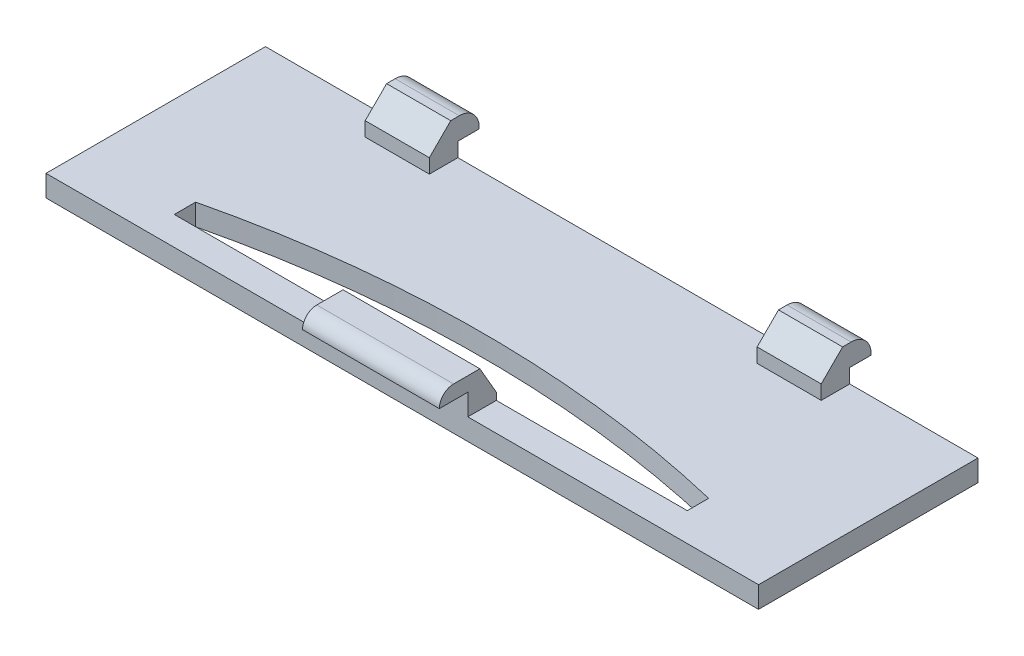
ISO-10303-21;
HEADER;
FILE_DESCRIPTION(('STEP AP214'),'2;1');
FILE_NAME('part.step','',(''),(''),'','','');
FILE_SCHEMA(('AUTOMOTIVE_DESIGN { 1 0 10303 214 1 1 1 1 }'));
ENDSEC;
DATA;
#1=APPLICATION_CONTEXT('core data for automotive mechanical design processes');
#2=APPLICATION_PROTOCOL_DEFINITION('international standard','automotive_design',2000,#1);
#3=PRODUCT_CONTEXT('',#1,'mechanical');
#4=PRODUCT('Part','Part','',(#3));
#5=PRODUCT_RELATED_PRODUCT_CATEGORY('part','',(#4));
#6=PRODUCT_DEFINITION_FORMATION('','',#4);
#7=PRODUCT_DEFINITION_CONTEXT('part definition',#1,'design');
#8=PRODUCT_DEFINITION('design','',#6,#7);
#9=PRODUCT_DEFINITION_SHAPE('','',#8);
#10=(LENGTH_UNIT() NAMED_UNIT(*) SI_UNIT(.MILLI.,.METRE.));
#11=(NAMED_UNIT(*) PLANE_ANGLE_UNIT() SI_UNIT($,.RADIAN.));
#12=(NAMED_UNIT(*) SI_UNIT($,.STERADIAN.) SOLID_ANGLE_UNIT());
#13=UNCERTAINTY_MEASURE_WITH_UNIT(LENGTH_MEASURE(1.E-05),#10,'distance_accuracy_value','');
#14=(GEOMETRIC_REPRESENTATION_CONTEXT(3) GLOBAL_UNCERTAINTY_ASSIGNED_CONTEXT((#13)) GLOBAL_UNIT_ASSIGNED_CONTEXT((#10,
#11,#12)) REPRESENTATION_CONTEXT('',''));
#15=CARTESIAN_POINT('',(0.,0.,0.));
#16=DIRECTION('',(0.,0.,1.));
#17=DIRECTION('',(1.,0.,0.));
#18=AXIS2_PLACEMENT_3D('',#15,#16,#17);
#19=CARTESIAN_POINT('',(0.,1.5,0.));
#20=DIRECTION('',(0.,1.,0.));
#21=DIRECTION('',(0.,0.,1.));
#22=AXIS2_PLACEMENT_3D('',#19,#20,#21);
#23=PLANE('',#22);
#24=DIRECTION('',(0.,0.,1.));
#25=VECTOR('',#24,1.);
#26=CARTESIAN_POINT('',(-79.2873563218391,1.5,-0.844827586206872));
#27=LINE('',#26,#25);
#28=CARTESIAN_POINT('',(-79.2873563218391,1.5,-0.844827586206872));
#29=VERTEX_POINT('',#28);
#30=CARTESIAN_POINT('',(-79.2873563218391,1.5,0.655172413793106));
#31=VERTEX_POINT('',#30);
#32=EDGE_CURVE('E288',#29,#31,#27,.T.);
#33=ORIENTED_EDGE('',*,*,#32,.F.);
#34=CARTESIAN_POINT('',(-61.287356321839,1.5,74.3895139735997));
#35=DIRECTION('',(0.,1.,0.));
#36=DIRECTION('',(0.,0.,1.));
#37=AXIS2_PLACEMENT_3D('',#34,#35,#36);
#38=CIRCLE('',#37,77.3576508817172);
#39=CARTESIAN_POINT('',(-43.2873563218391,1.5,-0.844827586206894));
#40=VERTEX_POINT('',#39);
#41=EDGE_CURVE('E253',#29,#40,#38,.F.);
#42=ORIENTED_EDGE('',*,*,#41,.T.);
#43=DIRECTION('',(0.,0.,-1.));
#44=VECTOR('',#43,1.);
#45=CARTESIAN_POINT('',(-43.2873563218391,1.5,-0.844827586206894));
#46=LINE('',#45,#44);
#47=CARTESIAN_POINT('',(-43.2873563218391,1.5,0.655172413793106));
#48=VERTEX_POINT('',#47);
#49=EDGE_CURVE('E259',#48,#40,#46,.T.);
#50=ORIENTED_EDGE('',*,*,#49,.F.);
#51=DIRECTION('',(1.,0.,0.));
#52=VECTOR('',#51,1.);
#53=CARTESIAN_POINT('',(-79.2873563218391,1.5,0.655172413793106));
#54=LINE('',#53,#52);
#55=CARTESIAN_POINT('',(-56.6873563218391,1.5,0.655172413793106));
#56=VERTEX_POINT('',#55);
#57=EDGE_CURVE('E424',#56,#48,#54,.T.);
#58=ORIENTED_EDGE('',*,*,#57,.F.);
#59=DIRECTION('',(0.,0.,-1.));
#60=VECTOR('',#59,1.);
#61=CARTESIAN_POINT('',(-56.6873563218391,1.5,0.655172413793106));
#62=LINE('',#61,#60);
#63=CARTESIAN_POINT('',(-56.6873563218391,1.5,2.65517241379311));
#64=VERTEX_POINT('',#63);
#65=EDGE_CURVE('E437',#64,#56,#62,.T.);
#66=ORIENTED_EDGE('',*,*,#65,.F.);
#67=DIRECTION('',(1.,0.,0.));
#68=VECTOR('',#67,1.);
#69=CARTESIAN_POINT('',(-36.2873563218391,1.5,2.6551724137931));
#70=LINE('',#69,#68);
#71=CARTESIAN_POINT('',(-36.2873563218391,1.5,2.6551724137931));
#72=VERTEX_POINT('',#71);
#73=EDGE_CURVE('E312',#64,#72,#70,.T.);
#74=ORIENTED_EDGE('',*,*,#73,.T.);
#75=DIRECTION('',(0.,0.,-1.));
#76=VECTOR('',#75,1.);
#77=CARTESIAN_POINT('',(-36.2873563218391,1.5,2.6551724137931));
#78=LINE('',#77,#76);
#79=CARTESIAN_POINT('',(-36.2873563218391,1.5,-12.7448275862069));
#80=VERTEX_POINT('',#79);
#81=EDGE_CURVE('E298',#72,#80,#78,.T.);
#82=ORIENTED_EDGE('',*,*,#81,.T.);
#83=DIRECTION('',(-1.,0.,0.));
#84=VECTOR('',#83,1.);
#85=CARTESIAN_POINT('',(-36.2873563218391,1.5,-12.7448275862069));
#86=LINE('',#85,#84);
#87=CARTESIAN_POINT('',(-45.2873563218391,1.5,-12.7448275862069));
#88=VERTEX_POINT('',#87);
#89=EDGE_CURVE('E304',#80,#88,#86,.T.);
#90=ORIENTED_EDGE('',*,*,#89,.T.);
#91=DIRECTION('',(0.,0.,-1.));
#92=VECTOR('',#91,1.);
#93=CARTESIAN_POINT('',(-45.2873563218391,1.5,-12.7448275862069));
#94=LINE('',#93,#92);
#95=CARTESIAN_POINT('',(-45.2873563218391,1.5,-10.7448275862069));
#96=VERTEX_POINT('',#95);
#97=EDGE_CURVE('E494',#96,#88,#94,.T.);
#98=ORIENTED_EDGE('',*,*,#97,.F.);
#99=DIRECTION('',(1.,0.,0.));
#100=VECTOR('',#99,1.);
#101=CARTESIAN_POINT('',(-49.7873563218391,1.5,-10.7448275862069));
#102=LINE('',#101,#100);
#103=CARTESIAN_POINT('',(-49.7873563218391,1.5,-10.7448275862069));
#104=VERTEX_POINT('',#103);
#105=EDGE_CURVE('E499',#104,#96,#102,.T.);
#106=ORIENTED_EDGE('',*,*,#105,.F.);
#107=DIRECTION('',(0.,0.,1.));
#108=VECTOR('',#107,1.);
#109=CARTESIAN_POINT('',(-49.7873563218391,1.5,-12.7448275862069));
#110=LINE('',#109,#108);
#111=CARTESIAN_POINT('',(-49.7873563218391,1.5,-12.7448275862069));
#112=VERTEX_POINT('',#111);
#113=EDGE_CURVE('E503',#112,#104,#110,.T.);
#114=ORIENTED_EDGE('',*,*,#113,.F.);
#115=CARTESIAN_POINT('',(-72.7873563218391,1.5,-12.7448275862069));
#116=VERTEX_POINT('',#115);
#117=EDGE_CURVE('E309',#112,#116,#86,.T.);
#118=ORIENTED_EDGE('',*,*,#117,.T.);
#119=DIRECTION('',(0.,0.,-1.));
#120=VECTOR('',#119,1.);
#121=CARTESIAN_POINT('',(-72.7873563218391,1.5,-12.7448275862069));
#122=LINE('',#121,#120);
#123=CARTESIAN_POINT('',(-72.7873563218391,1.5,-10.7448275862069));
#124=VERTEX_POINT('',#123);
#125=EDGE_CURVE('E463',#124,#116,#122,.T.);
#126=ORIENTED_EDGE('',*,*,#125,.F.);
#127=DIRECTION('',(1.,0.,0.));
#128=VECTOR('',#127,1.);
#129=CARTESIAN_POINT('',(-77.2873563218391,1.5,-10.7448275862069));
#130=LINE('',#129,#128);
#131=CARTESIAN_POINT('',(-77.2873563218391,1.5,-10.7448275862069));
#132=VERTEX_POINT('',#131);
#133=EDGE_CURVE('E468',#132,#124,#130,.T.);
#134=ORIENTED_EDGE('',*,*,#133,.F.);
#135=DIRECTION('',(0.,0.,1.));
#136=VECTOR('',#135,1.);
#137=CARTESIAN_POINT('',(-77.2873563218391,1.5,-12.7448275862069));
#138=LINE('',#137,#136);
#139=CARTESIAN_POINT('',(-77.2873563218391,1.5,-12.7448275862069));
#140=VERTEX_POINT('',#139);
#141=EDGE_CURVE('E472',#140,#132,#138,.T.);
#142=ORIENTED_EDGE('',*,*,#141,.F.);
#143=CARTESIAN_POINT('',(-86.2873563218391,1.5,-12.7448275862069));
#144=VERTEX_POINT('',#143);
#145=EDGE_CURVE('E302',#140,#144,#86,.T.);
#146=ORIENTED_EDGE('',*,*,#145,.T.);
#147=DIRECTION('',(0.,0.,1.));
#148=VECTOR('',#147,1.);
#149=CARTESIAN_POINT('',(-86.2873563218391,1.5,2.65517241379311));
#150=LINE('',#149,#148);
#151=CARTESIAN_POINT('',(-86.2873563218391,1.5,2.65517241379311));
#152=VERTEX_POINT('',#151);
#153=EDGE_CURVE('E308',#144,#152,#150,.T.);
#154=ORIENTED_EDGE('',*,*,#153,.T.);
#155=CARTESIAN_POINT('',(-66.2873563218391,1.5,2.65517241379311));
#156=VERTEX_POINT('',#155);
#157=EDGE_CURVE('E313',#152,#156,#70,.T.);
#158=ORIENTED_EDGE('',*,*,#157,.T.);
#159=DIRECTION('',(0.,0.,1.));
#160=VECTOR('',#159,1.);
#161=CARTESIAN_POINT('',(-66.2873563218391,1.5,0.655172413793106));
#162=LINE('',#161,#160);
#163=CARTESIAN_POINT('',(-66.2873563218391,1.5,0.655172413793106));
#164=VERTEX_POINT('',#163);
#165=EDGE_CURVE('E442',#164,#156,#162,.T.);
#166=ORIENTED_EDGE('',*,*,#165,.F.);
#167=EDGE_CURVE('E421',#31,#164,#54,.T.);
#168=ORIENTED_EDGE('',*,*,#167,.F.);
#169=EDGE_LOOP('',(#33,#42,#50,#58,#66,#74,#82,#90,#98,#106,#114,#118,#126,#134,#142,#146,#154,
#158,#166,#168));
#170=FACE_BOUND('',#169,.T.);
#171=ADVANCED_FACE('F45',(#170),#23,.T.);
#172=CARTESIAN_POINT('',(0.,0.,0.));
#173=DIRECTION('',(0.,1.,0.));
#174=DIRECTION('',(0.,0.,1.));
#175=AXIS2_PLACEMENT_3D('',#172,#173,#174);
#176=PLANE('',#175);
#177=DIRECTION('',(0.,0.,-1.));
#178=VECTOR('',#177,1.);
#179=CARTESIAN_POINT('',(-36.2873563218391,0.,2.6551724137931));
#180=LINE('',#179,#178);
#181=CARTESIAN_POINT('',(-36.2873563218391,0.,2.6551724137931));
#182=VERTEX_POINT('',#181);
#183=CARTESIAN_POINT('',(-36.2873563218391,0.,-12.7448275862069));
#184=VERTEX_POINT('',#183);
#185=EDGE_CURVE('E297',#182,#184,#180,.T.);
#186=ORIENTED_EDGE('',*,*,#185,.F.);
#187=DIRECTION('',(1.,0.,0.));
#188=VECTOR('',#187,1.);
#189=CARTESIAN_POINT('',(-36.2873563218391,0.,2.6551724137931));
#190=LINE('',#189,#188);
#191=CARTESIAN_POINT('',(-86.2873563218391,0.,2.65517241379311));
#192=VERTEX_POINT('',#191);
#193=EDGE_CURVE('E303',#192,#182,#190,.T.);
#194=ORIENTED_EDGE('',*,*,#193,.F.);
#195=DIRECTION('',(0.,0.,1.));
#196=VECTOR('',#195,1.);
#197=CARTESIAN_POINT('',(-86.2873563218391,0.,2.65517241379311));
#198=LINE('',#197,#196);
#199=CARTESIAN_POINT('',(-86.2873563218391,0.,-12.7448275862069));
#200=VERTEX_POINT('',#199);
#201=EDGE_CURVE('E324',#200,#192,#198,.T.);
#202=ORIENTED_EDGE('',*,*,#201,.F.);
#203=DIRECTION('',(-1.,0.,0.));
#204=VECTOR('',#203,1.);
#205=CARTESIAN_POINT('',(-36.2873563218391,0.,-12.7448275862069));
#206=LINE('',#205,#204);
#207=EDGE_CURVE('E321',#184,#200,#206,.T.);
#208=ORIENTED_EDGE('',*,*,#207,.F.);
#209=EDGE_LOOP('',(#186,#194,#202,#208));
#210=FACE_BOUND('',#209,.T.);
#211=CARTESIAN_POINT('',(-61.287356321839,0.,74.3895139735997));
#212=DIRECTION('',(0.,1.,0.));
#213=DIRECTION('',(0.,0.,-1.));
#214=AXIS2_PLACEMENT_3D('',#211,#212,#213);
#215=CIRCLE('',#214,77.3576508817172);
#216=CARTESIAN_POINT('',(-43.2873563218391,0.,-0.844827586206894));
#217=VERTEX_POINT('',#216);
#218=CARTESIAN_POINT('',(-79.2873563218391,0.,-0.844827586206872));
#219=VERTEX_POINT('',#218);
#220=EDGE_CURVE('E250',#217,#219,#215,.T.);
#221=ORIENTED_EDGE('',*,*,#220,.T.);
#222=DIRECTION('',(0.,0.,1.));
#223=VECTOR('',#222,1.);
#224=CARTESIAN_POINT('',(-79.2873563218391,0.,-0.844827586206872));
#225=LINE('',#224,#223);
#226=CARTESIAN_POINT('',(-79.2873563218391,0.,0.655172413793106));
#227=VERTEX_POINT('',#226);
#228=EDGE_CURVE('E266',#219,#227,#225,.T.);
#229=ORIENTED_EDGE('',*,*,#228,.T.);
#230=DIRECTION('',(1.,0.,0.));
#231=VECTOR('',#230,1.);
#232=CARTESIAN_POINT('',(-79.2873563218391,0.,0.655172413793106));
#233=LINE('',#232,#231);
#234=CARTESIAN_POINT('',(-43.2873563218391,0.,0.655172413793106));
#235=VERTEX_POINT('',#234);
#236=EDGE_CURVE('E276',#227,#235,#233,.T.);
#237=ORIENTED_EDGE('',*,*,#236,.T.);
#238=DIRECTION('',(0.,0.,-1.));
#239=VECTOR('',#238,1.);
#240=CARTESIAN_POINT('',(-43.2873563218391,0.,-0.844827586206894));
#241=LINE('',#240,#239);
#242=EDGE_CURVE('E268',#235,#217,#241,.T.);
#243=ORIENTED_EDGE('',*,*,#242,.T.);
#244=EDGE_LOOP('',(#221,#229,#237,#243));
#245=FACE_BOUND('',#244,.T.);
#246=ADVANCED_FACE('F264',(#210,#245),#176,.F.);
#247=CARTESIAN_POINT('',(-36.2873563218391,1.5,-12.7448275862069));
#248=DIRECTION('',(0.,0.,1.));
#249=DIRECTION('',(1.,0.,0.));
#250=AXIS2_PLACEMENT_3D('',#247,#248,#249);
#251=PLANE('',#250);
#252=DIRECTION('',(-1.,0.,0.));
#253=VECTOR('',#252,1.);
#254=CARTESIAN_POINT('',(-72.7873563218391,2.5,-12.7448275862069));
#255=LINE('',#254,#253);
#256=CARTESIAN_POINT('',(-72.7873563218391,2.5,-12.7448275862069));
#257=VERTEX_POINT('',#256);
#258=CARTESIAN_POINT('',(-77.2873563218391,2.5,-12.7448275862069));
#259=VERTEX_POINT('',#258);
#260=EDGE_CURVE('E556',#257,#259,#255,.T.);
#261=ORIENTED_EDGE('',*,*,#260,.F.);
#262=DIRECTION('',(0.,-1.,0.));
#263=VECTOR('',#262,1.);
#264=CARTESIAN_POINT('',(-72.7873563218391,4.,-12.7448275862069));
#265=LINE('',#264,#263);
#266=EDGE_CURVE('E456',#257,#116,#265,.T.);
#267=ORIENTED_EDGE('',*,*,#266,.T.);
#268=ORIENTED_EDGE('',*,*,#117,.F.);
#269=DIRECTION('',(0.,-1.,0.));
#270=VECTOR('',#269,1.);
#271=CARTESIAN_POINT('',(-49.7873563218391,4.,-12.7448275862069));
#272=LINE('',#271,#270);
#273=CARTESIAN_POINT('',(-49.7873563218391,2.5,-12.7448275862069));
#274=VERTEX_POINT('',#273);
#275=EDGE_CURVE('E490',#274,#112,#272,.T.);
#276=ORIENTED_EDGE('',*,*,#275,.F.);
#277=DIRECTION('',(-1.,0.,0.));
#278=VECTOR('',#277,1.);
#279=CARTESIAN_POINT('',(-45.2873563218391,2.5,-12.7448275862069));
#280=LINE('',#279,#278);
#281=CARTESIAN_POINT('',(-45.2873563218391,2.5,-12.7448275862069));
#282=VERTEX_POINT('',#281);
#283=EDGE_CURVE('E535',#282,#274,#280,.T.);
#284=ORIENTED_EDGE('',*,*,#283,.F.);
#285=DIRECTION('',(0.,-1.,0.));
#286=VECTOR('',#285,1.);
#287=CARTESIAN_POINT('',(-45.2873563218391,4.,-12.7448275862069));
#288=LINE('',#287,#286);
#289=EDGE_CURVE('E487',#282,#88,#288,.T.);
#290=ORIENTED_EDGE('',*,*,#289,.T.);
#291=ORIENTED_EDGE('',*,*,#89,.F.);
#292=DIRECTION('',(0.,-1.,0.));
#293=VECTOR('',#292,1.);
#294=CARTESIAN_POINT('',(-36.2873563218391,1.5,-12.7448275862069));
#295=LINE('',#294,#293);
#296=EDGE_CURVE('E340',#80,#184,#295,.T.);
#297=ORIENTED_EDGE('',*,*,#296,.T.);
#298=ORIENTED_EDGE('',*,*,#207,.T.);
#299=DIRECTION('',(0.,-1.,0.));
#300=VECTOR('',#299,1.);
#301=CARTESIAN_POINT('',(-86.2873563218391,1.5,-12.7448275862069));
#302=LINE('',#301,#300);
#303=EDGE_CURVE('E336',#144,#200,#302,.T.);
#304=ORIENTED_EDGE('',*,*,#303,.F.);
#305=ORIENTED_EDGE('',*,*,#145,.F.);
#306=DIRECTION('',(0.,-1.,0.));
#307=VECTOR('',#306,1.);
#308=CARTESIAN_POINT('',(-77.2873563218391,4.,-12.7448275862069));
#309=LINE('',#308,#307);
#310=EDGE_CURVE('E459',#259,#140,#309,.T.);
#311=ORIENTED_EDGE('',*,*,#310,.F.);
#312=EDGE_LOOP('',(#261,#267,#268,#276,#284,#290,#291,#297,#298,#304,#305,#311));
#313=FACE_BOUND('',#312,.T.);
#314=ADVANCED_FACE('F600',(#313),#251,.F.);
#315=CARTESIAN_POINT('',(-36.2873563218391,1.5,2.6551724137931));
#316=DIRECTION('',(-1.,0.,0.));
#317=DIRECTION('',(0.,0.,1.));
#318=AXIS2_PLACEMENT_3D('',#315,#316,#317);
#319=PLANE('',#318);
#320=ORIENTED_EDGE('',*,*,#185,.T.);
#321=ORIENTED_EDGE('',*,*,#296,.F.);
#322=ORIENTED_EDGE('',*,*,#81,.F.);
#323=DIRECTION('',(0.,-1.,0.));
#324=VECTOR('',#323,1.);
#325=CARTESIAN_POINT('',(-36.2873563218391,1.5,2.6551724137931));
#326=LINE('',#325,#324);
#327=EDGE_CURVE('E317',#72,#182,#326,.T.);
#328=ORIENTED_EDGE('',*,*,#327,.T.);
#329=EDGE_LOOP('',(#320,#321,#322,#328));
#330=FACE_BOUND('',#329,.T.);
#331=ADVANCED_FACE('F596',(#330),#319,.F.);
#332=CARTESIAN_POINT('',(-86.2873563218391,1.5,2.65517241379311));
#333=DIRECTION('',(1.,0.,0.));
#334=DIRECTION('',(0.,0.,-1.));
#335=AXIS2_PLACEMENT_3D('',#332,#333,#334);
#336=PLANE('',#335);
#337=ORIENTED_EDGE('',*,*,#201,.T.);
#338=DIRECTION('',(0.,-1.,0.));
#339=VECTOR('',#338,1.);
#340=CARTESIAN_POINT('',(-86.2873563218391,1.5,2.65517241379311));
#341=LINE('',#340,#339);
#342=EDGE_CURVE('E332',#152,#192,#341,.T.);
#343=ORIENTED_EDGE('',*,*,#342,.F.);
#344=ORIENTED_EDGE('',*,*,#153,.F.);
#345=ORIENTED_EDGE('',*,*,#303,.T.);
#346=EDGE_LOOP('',(#337,#343,#344,#345));
#347=FACE_BOUND('',#346,.T.);
#348=ADVANCED_FACE('F665',(#347),#336,.F.);
#349=CARTESIAN_POINT('',(-36.2873563218391,1.5,2.6551724137931));
#350=DIRECTION('',(0.,0.,-1.));
#351=DIRECTION('',(-1.,0.,0.));
#352=AXIS2_PLACEMENT_3D('',#349,#350,#351);
#353=PLANE('',#352);
#354=DIRECTION('',(0.,-1.,0.));
#355=VECTOR('',#354,1.);
#356=CARTESIAN_POINT('',(-56.6873563218391,4.,2.65517241379311));
#357=LINE('',#356,#355);
#358=CARTESIAN_POINT('',(-56.6873563218391,3.,2.6551724137931));
#359=VERTEX_POINT('',#358);
#360=EDGE_CURVE('E282',#359,#64,#357,.T.);
#361=ORIENTED_EDGE('',*,*,#360,.F.);
#362=DIRECTION('',(-1.,0.,0.));
#363=VECTOR('',#362,1.);
#364=CARTESIAN_POINT('',(0.,3.00000000000001,2.6551724137931));
#365=LINE('',#364,#363);
#366=CARTESIAN_POINT('',(-66.2873563218391,3.,2.65517241379311));
#367=VERTEX_POINT('',#366);
#368=EDGE_CURVE('E519',#359,#367,#365,.T.);
#369=ORIENTED_EDGE('',*,*,#368,.T.);
#370=DIRECTION('',(0.,-1.,0.));
#371=VECTOR('',#370,1.);
#372=CARTESIAN_POINT('',(-66.2873563218391,4.,2.65517241379311));
#373=LINE('',#372,#371);
#374=EDGE_CURVE('E277',#367,#156,#373,.T.);
#375=ORIENTED_EDGE('',*,*,#374,.T.);
#376=ORIENTED_EDGE('',*,*,#157,.F.);
#377=ORIENTED_EDGE('',*,*,#342,.T.);
#378=ORIENTED_EDGE('',*,*,#193,.T.);
#379=ORIENTED_EDGE('',*,*,#327,.F.);
#380=ORIENTED_EDGE('',*,*,#73,.F.);
#381=EDGE_LOOP('',(#361,#369,#375,#376,#377,#378,#379,#380));
#382=FACE_BOUND('',#381,.T.);
#383=ADVANCED_FACE('F589',(#382),#353,.F.);
#384=CARTESIAN_POINT('',(-79.2873563218391,1.5,-0.844827586206872));
#385=DIRECTION('',(1.,0.,0.));
#386=DIRECTION('',(0.,0.,-1.));
#387=AXIS2_PLACEMENT_3D('',#384,#385,#386);
#388=PLANE('',#387);
#389=ORIENTED_EDGE('',*,*,#228,.F.);
#390=DIRECTION('',(0.,-1.,0.));
#391=VECTOR('',#390,1.);
#392=CARTESIAN_POINT('',(-79.2873563218391,1.5,-0.844827586206872));
#393=LINE('',#392,#391);
#394=EDGE_CURVE('E247',#29,#219,#393,.T.);
#395=ORIENTED_EDGE('',*,*,#394,.F.);
#396=ORIENTED_EDGE('',*,*,#32,.T.);
#397=DIRECTION('',(0.,-1.,0.));
#398=VECTOR('',#397,1.);
#399=CARTESIAN_POINT('',(-79.2873563218391,1.5,0.655172413793106));
#400=LINE('',#399,#398);
#401=EDGE_CURVE('E274',#31,#227,#400,.T.);
#402=ORIENTED_EDGE('',*,*,#401,.T.);
#403=EDGE_LOOP('',(#389,#395,#396,#402));
#404=FACE_BOUND('',#403,.T.);
#405=ADVANCED_FACE('F272',(#404),#388,.T.);
#406=CARTESIAN_POINT('',(-79.2873563218391,1.5,0.655172413793106));
#407=DIRECTION('',(0.,0.,-1.));
#408=DIRECTION('',(-1.,0.,0.));
#409=AXIS2_PLACEMENT_3D('',#406,#407,#408);
#410=PLANE('',#409);
#411=DIRECTION('',(0.,-1.,0.));
#412=VECTOR('',#411,1.);
#413=CARTESIAN_POINT('',(-66.2873563218391,4.,0.655172413793106));
#414=LINE('',#413,#412);
#415=CARTESIAN_POINT('',(-66.2873563218391,1.99999999999999,0.655172413793106));
#416=VERTEX_POINT('',#415);
#417=EDGE_CURVE('E433',#416,#164,#414,.T.);
#418=ORIENTED_EDGE('',*,*,#417,.F.);
#419=DIRECTION('',(1.,0.,0.));
#420=VECTOR('',#419,1.);
#421=CARTESIAN_POINT('',(-79.2873563218391,1.99999999999999,0.655172413793106));
#422=LINE('',#421,#420);
#423=CARTESIAN_POINT('',(-56.6873563218391,1.99999999999999,0.655172413793106));
#424=VERTEX_POINT('',#423);
#425=EDGE_CURVE('E405',#416,#424,#422,.T.);
#426=ORIENTED_EDGE('',*,*,#425,.T.);
#427=DIRECTION('',(0.,-1.,0.));
#428=VECTOR('',#427,1.);
#429=CARTESIAN_POINT('',(-56.6873563218391,4.,0.655172413793106));
#430=LINE('',#429,#428);
#431=EDGE_CURVE('E430',#424,#56,#430,.T.);
#432=ORIENTED_EDGE('',*,*,#431,.T.);
#433=ORIENTED_EDGE('',*,*,#57,.T.);
#434=DIRECTION('',(0.,-1.,0.));
#435=VECTOR('',#434,1.);
#436=CARTESIAN_POINT('',(-43.2873563218391,1.5,0.655172413793106));
#437=LINE('',#436,#435);
#438=EDGE_CURVE('E292',#48,#235,#437,.T.);
#439=ORIENTED_EDGE('',*,*,#438,.T.);
#440=ORIENTED_EDGE('',*,*,#236,.F.);
#441=ORIENTED_EDGE('',*,*,#401,.F.);
#442=ORIENTED_EDGE('',*,*,#167,.T.);
#443=EDGE_LOOP('',(#418,#426,#432,#433,#439,#440,#441,#442));
#444=FACE_BOUND('',#443,.T.);
#445=ADVANCED_FACE('F578',(#444),#410,.T.);
#446=CARTESIAN_POINT('',(-43.2873563218391,1.5,-0.844827586206894));
#447=DIRECTION('',(-1.,0.,0.));
#448=DIRECTION('',(0.,0.,1.));
#449=AXIS2_PLACEMENT_3D('',#446,#447,#448);
#450=PLANE('',#449);
#451=ORIENTED_EDGE('',*,*,#242,.F.);
#452=ORIENTED_EDGE('',*,*,#438,.F.);
#453=ORIENTED_EDGE('',*,*,#49,.T.);
#454=DIRECTION('',(0.,-1.,0.));
#455=VECTOR('',#454,1.);
#456=CARTESIAN_POINT('',(-43.2873563218391,1.5,-0.844827586206894));
#457=LINE('',#456,#455);
#458=EDGE_CURVE('E258',#40,#217,#457,.T.);
#459=ORIENTED_EDGE('',*,*,#458,.T.);
#460=EDGE_LOOP('',(#451,#452,#453,#459));
#461=FACE_BOUND('',#460,.T.);
#462=ADVANCED_FACE('F575',(#461),#450,.T.);
#463=CARTESIAN_POINT('',(-66.2873563218391,4.,0.655172413793106));
#464=DIRECTION('',(1.,0.,0.));
#465=DIRECTION('',(0.,0.,-1.));
#466=AXIS2_PLACEMENT_3D('',#463,#464,#465);
#467=PLANE('',#466);
#468=DIRECTION('',(0.,0.,-1.));
#469=VECTOR('',#468,1.);
#470=CARTESIAN_POINT('',(-66.2873563218391,3.,4.6551724137931));
#471=LINE('',#470,#469);
#472=CARTESIAN_POINT('',(-66.2873563218391,3.,4.6551724137931));
#473=VERTEX_POINT('',#472);
#474=EDGE_CURVE('E515',#473,#367,#471,.T.);
#475=ORIENTED_EDGE('',*,*,#474,.F.);
#476=CARTESIAN_POINT('',(-66.2873563218391,3.,3.6551724137931));
#477=DIRECTION('',(1.,0.,0.));
#478=DIRECTION('',(0.,0.,-1.));
#479=AXIS2_PLACEMENT_3D('',#476,#477,#478);
#480=CIRCLE('',#479,1.);
#481=CARTESIAN_POINT('',(-66.2873563218391,4.,3.6551724137931));
#482=VERTEX_POINT('',#481);
#483=EDGE_CURVE('E68',#473,#482,#480,.F.);
#484=ORIENTED_EDGE('',*,*,#483,.T.);
#485=DIRECTION('',(0.,0.,1.));
#486=VECTOR('',#485,1.);
#487=CARTESIAN_POINT('',(-66.2873563218391,4.,0.655172413793106));
#488=LINE('',#487,#486);
#489=CARTESIAN_POINT('',(-66.2873563218391,4.,1.80987295217236));
#490=VERTEX_POINT('',#489);
#491=EDGE_CURVE('E441',#490,#482,#488,.T.);
#492=ORIENTED_EDGE('',*,*,#491,.F.);
#493=DIRECTION('',(0.,0.86602540378444,0.499999999999999));
#494=VECTOR('',#493,1.);
#495=CARTESIAN_POINT('',(-66.2873563218391,4.,1.80987295217236));
#496=LINE('',#495,#494);
#497=EDGE_CURVE('E402',#490,#416,#496,.F.);
#498=ORIENTED_EDGE('',*,*,#497,.T.);
#499=ORIENTED_EDGE('',*,*,#417,.T.);
#500=ORIENTED_EDGE('',*,*,#165,.T.);
#501=ORIENTED_EDGE('',*,*,#374,.F.);
#502=EDGE_LOOP('',(#475,#484,#492,#498,#499,#500,#501));
#503=FACE_BOUND('',#502,.T.);
#504=ADVANCED_FACE('F669',(#503),#467,.F.);
#505=CARTESIAN_POINT('',(-56.6873563218391,4.,0.655172413793106));
#506=DIRECTION('',(-1.,0.,0.));
#507=DIRECTION('',(0.,0.,1.));
#508=AXIS2_PLACEMENT_3D('',#505,#506,#507);
#509=PLANE('',#508);
#510=DIRECTION('',(0.,0.,-1.));
#511=VECTOR('',#510,1.);
#512=CARTESIAN_POINT('',(-56.6873563218391,4.,0.655172413793106));
#513=LINE('',#512,#511);
#514=CARTESIAN_POINT('',(-56.6873563218391,4.,3.6551724137931));
#515=VERTEX_POINT('',#514);
#516=CARTESIAN_POINT('',(-56.6873563218391,4.,1.80987295217236));
#517=VERTEX_POINT('',#516);
#518=EDGE_CURVE('E436',#515,#517,#513,.T.);
#519=ORIENTED_EDGE('',*,*,#518,.F.);
#520=CARTESIAN_POINT('',(-56.6873563218391,3.,3.6551724137931));
#521=DIRECTION('',(-1.,0.,0.));
#522=DIRECTION('',(0.,0.,1.));
#523=AXIS2_PLACEMENT_3D('',#520,#521,#522);
#524=CIRCLE('',#523,1.);
#525=CARTESIAN_POINT('',(-56.6873563218391,3.,4.6551724137931));
#526=VERTEX_POINT('',#525);
#527=EDGE_CURVE('E11',#515,#526,#524,.F.);
#528=ORIENTED_EDGE('',*,*,#527,.T.);
#529=DIRECTION('',(0.,0.,-1.));
#530=VECTOR('',#529,1.);
#531=CARTESIAN_POINT('',(-56.6873563218391,3.,4.6551724137931));
#532=LINE('',#531,#530);
#533=EDGE_CURVE('E507',#526,#359,#532,.T.);
#534=ORIENTED_EDGE('',*,*,#533,.T.);
#535=ORIENTED_EDGE('',*,*,#360,.T.);
#536=ORIENTED_EDGE('',*,*,#65,.T.);
#537=ORIENTED_EDGE('',*,*,#431,.F.);
#538=DIRECTION('',(0.,-0.86602540378444,-0.499999999999999));
#539=VECTOR('',#538,1.);
#540=CARTESIAN_POINT('',(-56.6873563218391,4.,1.80987295217236));
#541=LINE('',#540,#539);
#542=EDGE_CURVE('E408',#424,#517,#541,.F.);
#543=ORIENTED_EDGE('',*,*,#542,.T.);
#544=EDGE_LOOP('',(#519,#528,#534,#535,#536,#537,#543));
#545=FACE_BOUND('',#544,.T.);
#546=ADVANCED_FACE('F583',(#545),#509,.F.);
#547=CARTESIAN_POINT('',(0.,4.,0.));
#548=DIRECTION('',(0.,1.,0.));
#549=DIRECTION('',(0.,0.,1.));
#550=AXIS2_PLACEMENT_3D('',#547,#548,#549);
#551=PLANE('',#550);
#552=ORIENTED_EDGE('',*,*,#491,.T.);
#553=DIRECTION('',(-1.,0.,0.));
#554=VECTOR('',#553,1.);
#555=CARTESIAN_POINT('',(0.,4.,3.6551724137931));
#556=LINE('',#555,#554);
#557=EDGE_CURVE('E54',#482,#515,#556,.F.);
#558=ORIENTED_EDGE('',*,*,#557,.T.);
#559=ORIENTED_EDGE('',*,*,#518,.T.);
#560=DIRECTION('',(-1.,0.,0.));
#561=VECTOR('',#560,1.);
#562=CARTESIAN_POINT('',(0.,4.,1.80987295217236));
#563=LINE('',#562,#561);
#564=EDGE_CURVE('E398',#517,#490,#563,.T.);
#565=ORIENTED_EDGE('',*,*,#564,.T.);
#566=EDGE_LOOP('',(#552,#558,#559,#565));
#567=FACE_BOUND('',#566,.T.);
#568=ADVANCED_FACE('F826',(#567),#551,.T.);
#569=CARTESIAN_POINT('',(-77.2873563218391,4.,-12.7448275862069));
#570=DIRECTION('',(1.,0.,0.));
#571=DIRECTION('',(0.,0.,-1.));
#572=AXIS2_PLACEMENT_3D('',#569,#570,#571);
#573=PLANE('',#572);
#574=DIRECTION('',(0.,0.,1.));
#575=VECTOR('',#574,1.);
#576=CARTESIAN_POINT('',(-77.2873563218391,4.,-12.7448275862069));
#577=LINE('',#576,#575);
#578=CARTESIAN_POINT('',(-77.2873563218391,4.,-12.8448275862069));
#579=VERTEX_POINT('',#578);
#580=CARTESIAN_POINT('',(-77.2873563218391,4.,-12.2448275862069));
#581=VERTEX_POINT('',#580);
#582=EDGE_CURVE('E467',#579,#581,#577,.T.);
#583=ORIENTED_EDGE('',*,*,#582,.F.);
#584=CARTESIAN_POINT('',(-77.2873563218391,2.6,-12.8448275862069));
#585=DIRECTION('',(1.,0.,0.));
#586=DIRECTION('',(0.,0.,-1.));
#587=AXIS2_PLACEMENT_3D('',#584,#585,#586);
#588=CIRCLE('',#587,1.4);
#589=CARTESIAN_POINT('',(-77.2873563218391,2.6,-14.2448275862069));
#590=VERTEX_POINT('',#589);
#591=EDGE_CURVE('E382',#579,#590,#588,.F.);
#592=ORIENTED_EDGE('',*,*,#591,.T.);
#593=DIRECTION('',(0.,1.,0.));
#594=VECTOR('',#593,1.);
#595=CARTESIAN_POINT('',(-77.2873563218391,4.,-14.2448275862069));
#596=LINE('',#595,#594);
#597=CARTESIAN_POINT('',(-77.2873563218391,2.5,-14.2448275862069));
#598=VERTEX_POINT('',#597);
#599=EDGE_CURVE('E555',#598,#590,#596,.T.);
#600=ORIENTED_EDGE('',*,*,#599,.F.);
#601=DIRECTION('',(0.,0.,1.));
#602=VECTOR('',#601,1.);
#603=CARTESIAN_POINT('',(-77.2873563218391,2.5,-14.2448275862069));
#604=LINE('',#603,#602);
#605=EDGE_CURVE('E551',#598,#259,#604,.T.);
#606=ORIENTED_EDGE('',*,*,#605,.T.);
#607=ORIENTED_EDGE('',*,*,#310,.T.);
#608=ORIENTED_EDGE('',*,*,#141,.T.);
#609=DIRECTION('',(0.,-1.,0.));
#610=VECTOR('',#609,1.);
#611=CARTESIAN_POINT('',(-77.2873563218391,4.,-10.7448275862069));
#612=LINE('',#611,#610);
#613=CARTESIAN_POINT('',(-77.2873563218391,2.49999999999999,-10.7448275862069));
#614=VERTEX_POINT('',#613);
#615=EDGE_CURVE('E446',#614,#132,#612,.T.);
#616=ORIENTED_EDGE('',*,*,#615,.F.);
#617=DIRECTION('',(0.,0.707106781186549,-0.707106781186546));
#618=VECTOR('',#617,1.);
#619=CARTESIAN_POINT('',(-77.2873563218391,4.,-12.2448275862069));
#620=LINE('',#619,#618);
#621=EDGE_CURVE('E368',#614,#581,#620,.T.);
#622=ORIENTED_EDGE('',*,*,#621,.T.);
#623=EDGE_LOOP('',(#583,#592,#600,#606,#607,#608,#616,#622));
#624=FACE_BOUND('',#623,.T.);
#625=ADVANCED_FACE('F656',(#624),#573,.F.);
#626=CARTESIAN_POINT('',(-77.2873563218391,4.,-10.7448275862069));
#627=DIRECTION('',(0.,0.,-1.));
#628=DIRECTION('',(-1.,0.,0.));
#629=AXIS2_PLACEMENT_3D('',#626,#627,#628);
#630=PLANE('',#629);
#631=DIRECTION('',(0.,-1.,0.));
#632=VECTOR('',#631,1.);
#633=CARTESIAN_POINT('',(-72.7873563218391,4.,-10.7448275862069));
#634=LINE('',#633,#632);
#635=CARTESIAN_POINT('',(-72.7873563218391,2.49999999999999,-10.7448275862069));
#636=VERTEX_POINT('',#635);
#637=EDGE_CURVE('E453',#636,#124,#634,.T.);
#638=ORIENTED_EDGE('',*,*,#637,.F.);
#639=DIRECTION('',(-1.,0.,0.));
#640=VECTOR('',#639,1.);
#641=CARTESIAN_POINT('',(-77.2873563218391,2.49999999999999,-10.7448275862069));
#642=LINE('',#641,#640);
#643=EDGE_CURVE('E365',#636,#614,#642,.T.);
#644=ORIENTED_EDGE('',*,*,#643,.T.);
#645=ORIENTED_EDGE('',*,*,#615,.T.);
#646=ORIENTED_EDGE('',*,*,#133,.T.);
#647=EDGE_LOOP('',(#638,#644,#645,#646));
#648=FACE_BOUND('',#647,.T.);
#649=ADVANCED_FACE('F648',(#648),#630,.F.);
#650=CARTESIAN_POINT('',(-72.7873563218391,4.,-12.7448275862069));
#651=DIRECTION('',(-1.,0.,0.));
#652=DIRECTION('',(0.,0.,1.));
#653=AXIS2_PLACEMENT_3D('',#650,#651,#652);
#654=PLANE('',#653);
#655=DIRECTION('',(0.,-1.,0.));
#656=VECTOR('',#655,1.);
#657=CARTESIAN_POINT('',(-72.7873563218391,4.,-14.2448275862069));
#658=LINE('',#657,#656);
#659=CARTESIAN_POINT('',(-72.7873563218391,2.6,-14.2448275862069));
#660=VERTEX_POINT('',#659);
#661=CARTESIAN_POINT('',(-72.7873563218391,2.5,-14.2448275862069));
#662=VERTEX_POINT('',#661);
#663=EDGE_CURVE('E559',#660,#662,#658,.T.);
#664=ORIENTED_EDGE('',*,*,#663,.F.);
#665=CARTESIAN_POINT('',(-72.7873563218391,2.6,-12.8448275862069));
#666=DIRECTION('',(-1.,0.,0.));
#667=DIRECTION('',(0.,0.,1.));
#668=AXIS2_PLACEMENT_3D('',#665,#666,#667);
#669=CIRCLE('',#668,1.4);
#670=CARTESIAN_POINT('',(-72.7873563218391,4.,-12.8448275862069));
#671=VERTEX_POINT('',#670);
#672=EDGE_CURVE('E376',#660,#671,#669,.F.);
#673=ORIENTED_EDGE('',*,*,#672,.T.);
#674=DIRECTION('',(0.,0.,-1.));
#675=VECTOR('',#674,1.);
#676=CARTESIAN_POINT('',(-72.7873563218391,4.,-12.7448275862069));
#677=LINE('',#676,#675);
#678=CARTESIAN_POINT('',(-72.7873563218391,4.,-12.2448275862069));
#679=VERTEX_POINT('',#678);
#680=EDGE_CURVE('E462',#679,#671,#677,.T.);
#681=ORIENTED_EDGE('',*,*,#680,.F.);
#682=DIRECTION('',(0.,-0.707106781186549,0.707106781186546));
#683=VECTOR('',#682,1.);
#684=CARTESIAN_POINT('',(-72.7873563218391,4.,-12.2448275862069));
#685=LINE('',#684,#683);
#686=EDGE_CURVE('E362',#679,#636,#685,.T.);
#687=ORIENTED_EDGE('',*,*,#686,.T.);
#688=ORIENTED_EDGE('',*,*,#637,.T.);
#689=ORIENTED_EDGE('',*,*,#125,.T.);
#690=ORIENTED_EDGE('',*,*,#266,.F.);
#691=DIRECTION('',(0.,0.,1.));
#692=VECTOR('',#691,1.);
#693=CARTESIAN_POINT('',(-72.7873563218391,2.5,-14.2448275862069));
#694=LINE('',#693,#692);
#695=EDGE_CURVE('E540',#662,#257,#694,.T.);
#696=ORIENTED_EDGE('',*,*,#695,.F.);
#697=EDGE_LOOP('',(#664,#673,#681,#687,#688,#689,#690,#696));
#698=FACE_BOUND('',#697,.T.);
#699=ADVANCED_FACE('F642',(#698),#654,.F.);
#700=CARTESIAN_POINT('',(0.,4.,0.));
#701=DIRECTION('',(0.,1.,0.));
#702=DIRECTION('',(0.,0.,1.));
#703=AXIS2_PLACEMENT_3D('',#700,#701,#702);
#704=PLANE('',#703);
#705=ORIENTED_EDGE('',*,*,#680,.T.);
#706=DIRECTION('',(1.,0.,0.));
#707=VECTOR('',#706,1.);
#708=CARTESIAN_POINT('',(0.,4.,-12.8448275862069));
#709=LINE('',#708,#707);
#710=EDGE_CURVE('E379',#671,#579,#709,.F.);
#711=ORIENTED_EDGE('',*,*,#710,.T.);
#712=ORIENTED_EDGE('',*,*,#582,.T.);
#713=DIRECTION('',(1.,0.,0.));
#714=VECTOR('',#713,1.);
#715=CARTESIAN_POINT('',(-72.7873563218391,4.,-12.2448275862069));
#716=LINE('',#715,#714);
#717=EDGE_CURVE('E358',#581,#679,#716,.T.);
#718=ORIENTED_EDGE('',*,*,#717,.T.);
#719=EDGE_LOOP('',(#705,#711,#712,#718));
#720=FACE_BOUND('',#719,.T.);
#721=ADVANCED_FACE('F880',(#720),#704,.T.);
#722=CARTESIAN_POINT('',(-49.7873563218391,4.,-12.7448275862069));
#723=DIRECTION('',(1.,0.,0.));
#724=DIRECTION('',(0.,0.,-1.));
#725=AXIS2_PLACEMENT_3D('',#722,#723,#724);
#726=PLANE('',#725);
#727=DIRECTION('',(0.,0.,1.));
#728=VECTOR('',#727,1.);
#729=CARTESIAN_POINT('',(-49.7873563218391,4.,-12.7448275862069));
#730=LINE('',#729,#728);
#731=CARTESIAN_POINT('',(-49.7873563218391,4.,-12.8448275862069));
#732=VERTEX_POINT('',#731);
#733=CARTESIAN_POINT('',(-49.7873563218391,4.,-12.2448275862069));
#734=VERTEX_POINT('',#733);
#735=EDGE_CURVE('E498',#732,#734,#730,.T.);
#736=ORIENTED_EDGE('',*,*,#735,.F.);
#737=CARTESIAN_POINT('',(-49.7873563218391,2.6,-12.8448275862069));
#738=DIRECTION('',(1.,0.,0.));
#739=DIRECTION('',(0.,0.,-1.));
#740=AXIS2_PLACEMENT_3D('',#737,#738,#739);
#741=CIRCLE('',#740,1.4);
#742=CARTESIAN_POINT('',(-49.7873563218391,2.6,-14.2448275862069));
#743=VERTEX_POINT('',#742);
#744=EDGE_CURVE('E395',#732,#743,#741,.F.);
#745=ORIENTED_EDGE('',*,*,#744,.T.);
#746=DIRECTION('',(0.,1.,0.));
#747=VECTOR('',#746,1.);
#748=CARTESIAN_POINT('',(-49.7873563218391,4.,-14.2448275862069));
#749=LINE('',#748,#747);
#750=CARTESIAN_POINT('',(-49.7873563218391,2.5,-14.2448275862069));
#751=VERTEX_POINT('',#750);
#752=EDGE_CURVE('E534',#751,#743,#749,.T.);
#753=ORIENTED_EDGE('',*,*,#752,.F.);
#754=DIRECTION('',(0.,0.,1.));
#755=VECTOR('',#754,1.);
#756=CARTESIAN_POINT('',(-49.7873563218391,2.5,-14.2448275862069));
#757=LINE('',#756,#755);
#758=EDGE_CURVE('E530',#751,#274,#757,.T.);
#759=ORIENTED_EDGE('',*,*,#758,.T.);
#760=ORIENTED_EDGE('',*,*,#275,.T.);
#761=ORIENTED_EDGE('',*,*,#113,.T.);
#762=DIRECTION('',(0.,-1.,0.));
#763=VECTOR('',#762,1.);
#764=CARTESIAN_POINT('',(-49.7873563218391,4.,-10.7448275862069));
#765=LINE('',#764,#763);
#766=CARTESIAN_POINT('',(-49.7873563218391,2.49999999999999,-10.7448275862069));
#767=VERTEX_POINT('',#766);
#768=EDGE_CURVE('E476',#767,#104,#765,.T.);
#769=ORIENTED_EDGE('',*,*,#768,.F.);
#770=DIRECTION('',(0.,0.707106781186549,-0.707106781186546));
#771=VECTOR('',#770,1.);
#772=CARTESIAN_POINT('',(-49.7873563218391,4.00000000000001,-12.2448275862069));
#773=LINE('',#772,#771);
#774=EDGE_CURVE('E354',#767,#734,#773,.T.);
#775=ORIENTED_EDGE('',*,*,#774,.T.);
#776=EDGE_LOOP('',(#736,#745,#753,#759,#760,#761,#769,#775));
#777=FACE_BOUND('',#776,.T.);
#778=ADVANCED_FACE('F625',(#777),#726,.F.);
#779=CARTESIAN_POINT('',(-49.7873563218391,4.,-10.7448275862069));
#780=DIRECTION('',(0.,0.,-1.));
#781=DIRECTION('',(-1.,0.,0.));
#782=AXIS2_PLACEMENT_3D('',#779,#780,#781);
#783=PLANE('',#782);
#784=DIRECTION('',(0.,-1.,0.));
#785=VECTOR('',#784,1.);
#786=CARTESIAN_POINT('',(-45.2873563218391,4.,-10.7448275862069));
#787=LINE('',#786,#785);
#788=CARTESIAN_POINT('',(-45.2873563218391,2.49999999999999,-10.7448275862069));
#789=VERTEX_POINT('',#788);
#790=EDGE_CURVE('E484',#789,#96,#787,.T.);
#791=ORIENTED_EDGE('',*,*,#790,.F.);
#792=DIRECTION('',(-1.,0.,0.));
#793=VECTOR('',#792,1.);
#794=CARTESIAN_POINT('',(-49.7873563218391,2.49999999999999,-10.7448275862069));
#795=LINE('',#794,#793);
#796=EDGE_CURVE('E351',#789,#767,#795,.T.);
#797=ORIENTED_EDGE('',*,*,#796,.T.);
#798=ORIENTED_EDGE('',*,*,#768,.T.);
#799=ORIENTED_EDGE('',*,*,#105,.T.);
#800=EDGE_LOOP('',(#791,#797,#798,#799));
#801=FACE_BOUND('',#800,.T.);
#802=ADVANCED_FACE('F633',(#801),#783,.F.);
#803=CARTESIAN_POINT('',(-45.2873563218391,4.,-12.7448275862069));
#804=DIRECTION('',(-1.,0.,0.));
#805=DIRECTION('',(0.,0.,1.));
#806=AXIS2_PLACEMENT_3D('',#803,#804,#805);
#807=PLANE('',#806);
#808=DIRECTION('',(0.,-1.,0.));
#809=VECTOR('',#808,1.);
#810=CARTESIAN_POINT('',(-45.2873563218391,4.,-14.2448275862069));
#811=LINE('',#810,#809);
#812=CARTESIAN_POINT('',(-45.2873563218391,2.6,-14.2448275862069));
#813=VERTEX_POINT('',#812);
#814=CARTESIAN_POINT('',(-45.2873563218391,2.5,-14.2448275862069));
#815=VERTEX_POINT('',#814);
#816=EDGE_CURVE('E539',#813,#815,#811,.T.);
#817=ORIENTED_EDGE('',*,*,#816,.F.);
#818=CARTESIAN_POINT('',(-45.2873563218391,2.6,-12.8448275862069));
#819=DIRECTION('',(-1.,0.,0.));
#820=DIRECTION('',(0.,0.,1.));
#821=AXIS2_PLACEMENT_3D('',#818,#819,#820);
#822=CIRCLE('',#821,1.4);
#823=CARTESIAN_POINT('',(-45.2873563218391,4.,-12.8448275862069));
#824=VERTEX_POINT('',#823);
#825=EDGE_CURVE('E389',#813,#824,#822,.F.);
#826=ORIENTED_EDGE('',*,*,#825,.T.);
#827=DIRECTION('',(0.,0.,-1.));
#828=VECTOR('',#827,1.);
#829=CARTESIAN_POINT('',(-45.2873563218391,4.,-12.7448275862069));
#830=LINE('',#829,#828);
#831=CARTESIAN_POINT('',(-45.2873563218391,4.,-12.2448275862069));
#832=VERTEX_POINT('',#831);
#833=EDGE_CURVE('E493',#832,#824,#830,.T.);
#834=ORIENTED_EDGE('',*,*,#833,.F.);
#835=DIRECTION('',(0.,-0.707106781186549,0.707106781186546));
#836=VECTOR('',#835,1.);
#837=CARTESIAN_POINT('',(-45.2873563218391,4.00000000000001,-12.2448275862069));
#838=LINE('',#837,#836);
#839=EDGE_CURVE('E348',#832,#789,#838,.T.);
#840=ORIENTED_EDGE('',*,*,#839,.T.);
#841=ORIENTED_EDGE('',*,*,#790,.T.);
#842=ORIENTED_EDGE('',*,*,#97,.T.);
#843=ORIENTED_EDGE('',*,*,#289,.F.);
#844=DIRECTION('',(0.,0.,1.));
#845=VECTOR('',#844,1.);
#846=CARTESIAN_POINT('',(-45.2873563218391,2.5,-14.2448275862069));
#847=LINE('',#846,#845);
#848=EDGE_CURVE('E523',#815,#282,#847,.T.);
#849=ORIENTED_EDGE('',*,*,#848,.F.);
#850=EDGE_LOOP('',(#817,#826,#834,#840,#841,#842,#843,#849));
#851=FACE_BOUND('',#850,.T.);
#852=ADVANCED_FACE('F606',(#851),#807,.F.);
#853=CARTESIAN_POINT('',(0.,4.,0.));
#854=DIRECTION('',(0.,1.,0.));
#855=DIRECTION('',(0.,0.,1.));
#856=AXIS2_PLACEMENT_3D('',#853,#854,#855);
#857=PLANE('',#856);
#858=ORIENTED_EDGE('',*,*,#833,.T.);
#859=DIRECTION('',(1.,0.,0.));
#860=VECTOR('',#859,1.);
#861=CARTESIAN_POINT('',(0.,4.,-12.8448275862069));
#862=LINE('',#861,#860);
#863=EDGE_CURVE('E392',#824,#732,#862,.F.);
#864=ORIENTED_EDGE('',*,*,#863,.T.);
#865=ORIENTED_EDGE('',*,*,#735,.T.);
#866=DIRECTION('',(1.,0.,0.));
#867=VECTOR('',#866,1.);
#868=CARTESIAN_POINT('',(-45.2873563218391,4.,-12.2448275862069));
#869=LINE('',#868,#867);
#870=EDGE_CURVE('E344',#734,#832,#869,.T.);
#871=ORIENTED_EDGE('',*,*,#870,.T.);
#872=EDGE_LOOP('',(#858,#864,#865,#871));
#873=FACE_BOUND('',#872,.T.);
#874=ADVANCED_FACE('F619',(#873),#857,.T.);
#875=CARTESIAN_POINT('',(0.,4.,-12.2448275862069));
#876=DIRECTION('',(0.,0.707106781186546,0.707106781186549));
#877=DIRECTION('',(-1.,0.,0.));
#878=AXIS2_PLACEMENT_3D('',#875,#876,#877);
#879=PLANE('',#878);
#880=ORIENTED_EDGE('',*,*,#774,.F.);
#881=ORIENTED_EDGE('',*,*,#796,.F.);
#882=ORIENTED_EDGE('',*,*,#839,.F.);
#883=ORIENTED_EDGE('',*,*,#870,.F.);
#884=EDGE_LOOP('',(#880,#881,#882,#883));
#885=FACE_BOUND('',#884,.T.);
#886=ADVANCED_FACE('F630',(#885),#879,.T.);
#887=CARTESIAN_POINT('',(0.,4.,-12.2448275862069));
#888=DIRECTION('',(0.,0.707106781186546,0.707106781186549));
#889=DIRECTION('',(-1.,0.,0.));
#890=AXIS2_PLACEMENT_3D('',#887,#888,#889);
#891=PLANE('',#890);
#892=ORIENTED_EDGE('',*,*,#621,.F.);
#893=ORIENTED_EDGE('',*,*,#643,.F.);
#894=ORIENTED_EDGE('',*,*,#686,.F.);
#895=ORIENTED_EDGE('',*,*,#717,.F.);
#896=EDGE_LOOP('',(#892,#893,#894,#895));
#897=FACE_BOUND('',#896,.T.);
#898=ADVANCED_FACE('F652',(#897),#891,.T.);
#899=CARTESIAN_POINT('',(0.,3.00000000000001,4.6551724137931));
#900=DIRECTION('',(0.,-1.,0.));
#901=DIRECTION('',(1.,0.,0.));
#902=AXIS2_PLACEMENT_3D('',#899,#900,#901);
#903=PLANE('',#902);
#904=ORIENTED_EDGE('',*,*,#368,.F.);
#905=ORIENTED_EDGE('',*,*,#533,.F.);
#906=DIRECTION('',(-1.,0.,0.));
#907=VECTOR('',#906,1.);
#908=CARTESIAN_POINT('',(0.,3.00000000000001,4.6551724137931));
#909=LINE('',#908,#907);
#910=EDGE_CURVE('E518',#526,#473,#909,.T.);
#911=ORIENTED_EDGE('',*,*,#910,.T.);
#912=ORIENTED_EDGE('',*,*,#474,.T.);
#913=EDGE_LOOP('',(#904,#905,#911,#912));
#914=FACE_BOUND('',#913,.T.);
#915=ADVANCED_FACE('F678',(#914),#903,.T.);
#916=CARTESIAN_POINT('',(-45.2873563218391,2.5,-14.2448275862069));
#917=DIRECTION('',(0.,1.,0.));
#918=DIRECTION('',(0.,0.,1.));
#919=AXIS2_PLACEMENT_3D('',#916,#917,#918);
#920=PLANE('',#919);
#921=ORIENTED_EDGE('',*,*,#283,.T.);
#922=ORIENTED_EDGE('',*,*,#758,.F.);
#923=DIRECTION('',(-1.,0.,0.));
#924=VECTOR('',#923,1.);
#925=CARTESIAN_POINT('',(-45.2873563218391,2.5,-14.2448275862069));
#926=LINE('',#925,#924);
#927=EDGE_CURVE('E544',#815,#751,#926,.T.);
#928=ORIENTED_EDGE('',*,*,#927,.F.);
#929=ORIENTED_EDGE('',*,*,#848,.T.);
#930=EDGE_LOOP('',(#921,#922,#928,#929));
#931=FACE_BOUND('',#930,.T.);
#932=ADVANCED_FACE('F609',(#931),#920,.F.);
#933=CARTESIAN_POINT('',(0.,0.,-14.2448275862069));
#934=DIRECTION('',(0.,0.,-1.));
#935=DIRECTION('',(-1.,0.,0.));
#936=AXIS2_PLACEMENT_3D('',#933,#934,#935);
#937=PLANE('',#936);
#938=ORIENTED_EDGE('',*,*,#752,.T.);
#939=DIRECTION('',(1.,0.,0.));
#940=VECTOR('',#939,1.);
#941=CARTESIAN_POINT('',(0.,2.6,-14.2448275862069));
#942=LINE('',#941,#940);
#943=EDGE_CURVE('E385',#743,#813,#942,.T.);
#944=ORIENTED_EDGE('',*,*,#943,.T.);
#945=ORIENTED_EDGE('',*,*,#816,.T.);
#946=ORIENTED_EDGE('',*,*,#927,.T.);
#947=EDGE_LOOP('',(#938,#944,#945,#946));
#948=FACE_BOUND('',#947,.T.);
#949=ADVANCED_FACE('F613',(#948),#937,.T.);
#950=CARTESIAN_POINT('',(-72.7873563218391,2.5,-14.2448275862069));
#951=DIRECTION('',(0.,1.,0.));
#952=DIRECTION('',(0.,0.,1.));
#953=AXIS2_PLACEMENT_3D('',#950,#951,#952);
#954=PLANE('',#953);
#955=ORIENTED_EDGE('',*,*,#260,.T.);
#956=ORIENTED_EDGE('',*,*,#605,.F.);
#957=DIRECTION('',(-1.,0.,0.));
#958=VECTOR('',#957,1.);
#959=CARTESIAN_POINT('',(-72.7873563218391,2.5,-14.2448275862069));
#960=LINE('',#959,#958);
#961=EDGE_CURVE('E563',#662,#598,#960,.T.);
#962=ORIENTED_EDGE('',*,*,#961,.F.);
#963=ORIENTED_EDGE('',*,*,#695,.T.);
#964=EDGE_LOOP('',(#955,#956,#962,#963));
#965=FACE_BOUND('',#964,.T.);
#966=ADVANCED_FACE('F734',(#965),#954,.F.);
#967=CARTESIAN_POINT('',(0.,0.,-14.2448275862069));
#968=DIRECTION('',(0.,0.,-1.));
#969=DIRECTION('',(-1.,0.,0.));
#970=AXIS2_PLACEMENT_3D('',#967,#968,#969);
#971=PLANE('',#970);
#972=ORIENTED_EDGE('',*,*,#599,.T.);
#973=DIRECTION('',(1.,0.,0.));
#974=VECTOR('',#973,1.);
#975=CARTESIAN_POINT('',(0.,2.6,-14.2448275862069));
#976=LINE('',#975,#974);
#977=EDGE_CURVE('E372',#590,#660,#976,.T.);
#978=ORIENTED_EDGE('',*,*,#977,.T.);
#979=ORIENTED_EDGE('',*,*,#663,.T.);
#980=ORIENTED_EDGE('',*,*,#961,.T.);
#981=EDGE_LOOP('',(#972,#978,#979,#980));
#982=FACE_BOUND('',#981,.T.);
#983=ADVANCED_FACE('F718',(#982),#971,.T.);
#984=CARTESIAN_POINT('',(0.,2.6,-12.8448275862069));
#985=DIRECTION('',(1.,0.,0.));
#986=DIRECTION('',(0.,0.,-1.));
#987=AXIS2_PLACEMENT_3D('',#984,#985,#986);
#988=CYLINDRICAL_SURFACE('',#987,1.4);
#989=ORIENTED_EDGE('',*,*,#591,.F.);
#990=ORIENTED_EDGE('',*,*,#710,.F.);
#991=ORIENTED_EDGE('',*,*,#672,.F.);
#992=ORIENTED_EDGE('',*,*,#977,.F.);
#993=EDGE_LOOP('',(#989,#990,#991,#992));
#994=FACE_BOUND('',#993,.T.);
#995=ADVANCED_FACE('F715',(#994),#988,.T.);
#996=CARTESIAN_POINT('',(0.,2.6,-12.8448275862069));
#997=DIRECTION('',(1.,0.,0.));
#998=DIRECTION('',(0.,0.,-1.));
#999=AXIS2_PLACEMENT_3D('',#996,#997,#998);
#1000=CYLINDRICAL_SURFACE('',#999,1.4);
#1001=ORIENTED_EDGE('',*,*,#744,.F.);
#1002=ORIENTED_EDGE('',*,*,#863,.F.);
#1003=ORIENTED_EDGE('',*,*,#825,.F.);
#1004=ORIENTED_EDGE('',*,*,#943,.F.);
#1005=EDGE_LOOP('',(#1001,#1002,#1003,#1004));
#1006=FACE_BOUND('',#1005,.T.);
#1007=ADVANCED_FACE('F623',(#1006),#1000,.T.);
#1008=CARTESIAN_POINT('',(-61.287356321839,4.,74.3895139735997));
#1009=DIRECTION('',(0.,-1.,0.));
#1010=DIRECTION('',(0.,0.,-1.));
#1011=AXIS2_PLACEMENT_3D('',#1008,#1009,#1010);
#1012=CYLINDRICAL_SURFACE('',#1011,77.3576508817172);
#1013=ORIENTED_EDGE('',*,*,#394,.T.);
#1014=ORIENTED_EDGE('',*,*,#220,.F.);
#1015=ORIENTED_EDGE('',*,*,#458,.F.);
#1016=ORIENTED_EDGE('',*,*,#41,.F.);
#1017=EDGE_LOOP('',(#1013,#1014,#1015,#1016));
#1018=FACE_BOUND('',#1017,.T.);
#1019=ADVANCED_FACE('F249',(#1018),#1012,.F.);
#1020=CARTESIAN_POINT('',(0.,4.,1.80987295217236));
#1021=DIRECTION('',(0.,-0.499999999999999,0.866025403784439));
#1022=DIRECTION('',(-1.,0.,0.));
#1023=AXIS2_PLACEMENT_3D('',#1020,#1021,#1022);
#1024=PLANE('',#1023);
#1025=ORIENTED_EDGE('',*,*,#542,.F.);
#1026=ORIENTED_EDGE('',*,*,#425,.F.);
#1027=ORIENTED_EDGE('',*,*,#497,.F.);
#1028=ORIENTED_EDGE('',*,*,#564,.F.);
#1029=EDGE_LOOP('',(#1025,#1026,#1027,#1028));
#1030=FACE_BOUND('',#1029,.T.);
#1031=ADVANCED_FACE('F672',(#1030),#1024,.F.);
#1032=CARTESIAN_POINT('',(0.,3.,3.6551724137931));
#1033=DIRECTION('',(-1.,0.,0.));
#1034=DIRECTION('',(0.,0.,1.));
#1035=AXIS2_PLACEMENT_3D('',#1032,#1033,#1034);
#1036=CYLINDRICAL_SURFACE('',#1035,1.);
#1037=ORIENTED_EDGE('',*,*,#527,.F.);
#1038=ORIENTED_EDGE('',*,*,#557,.F.);
#1039=ORIENTED_EDGE('',*,*,#483,.F.);
#1040=ORIENTED_EDGE('',*,*,#910,.F.);
#1041=EDGE_LOOP('',(#1037,#1038,#1039,#1040));
#1042=FACE_BOUND('',#1041,.T.);
#1043=ADVANCED_FACE('F47',(#1042),#1036,.T.);
#1044=CLOSED_SHELL('',(#171,#246,#314,#331,#348,#383,#405,#445,#462,#504,#546,#568,#625,#649,
#699,#721,#778,#802,#852,#874,#886,#898,#915,#932,#949,#966,#983,#995,#1007,#1019,#1031,#1043));
#1045=MANIFOLD_SOLID_BREP('B2',#1044);
#1046=ADVANCED_BREP_SHAPE_REPRESENTATION('',(#18,#1045),#14);
#1047=SHAPE_DEFINITION_REPRESENTATION(#9,#1046);
ENDSEC;
END-ISO-10303-21;
